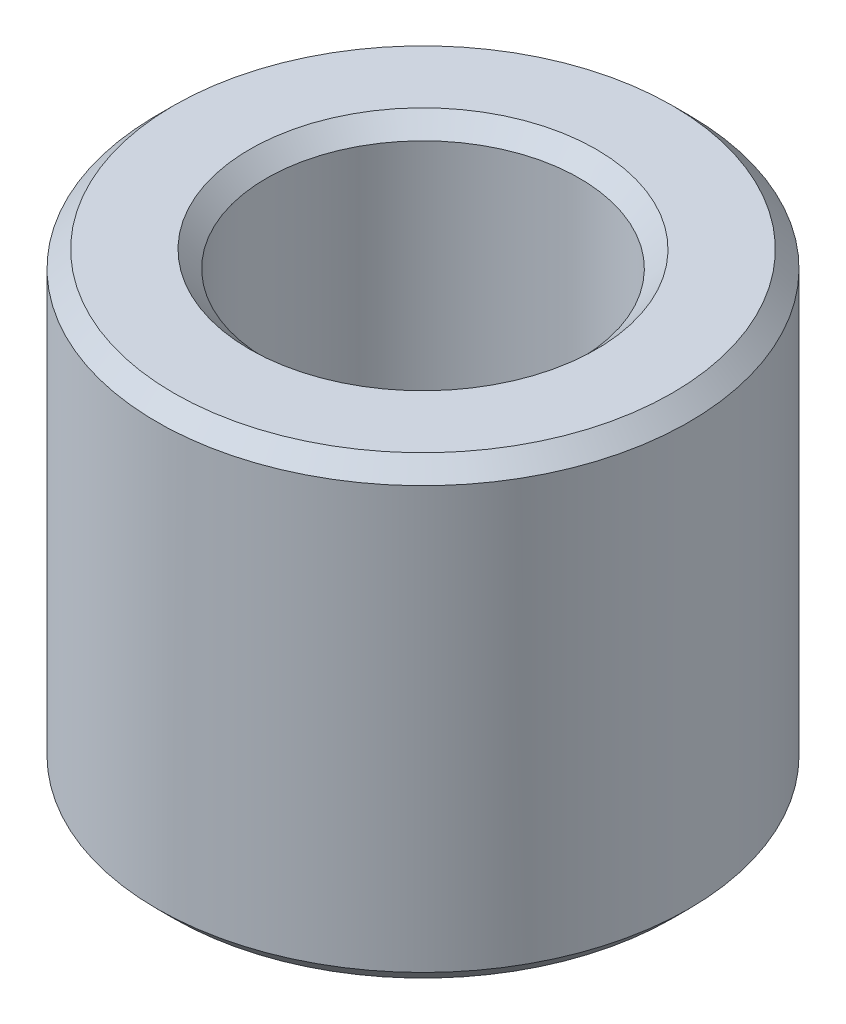
ISO-10303-21;
HEADER;
FILE_DESCRIPTION(('STEP AP214'),'2;1');
FILE_NAME('part.step','',(''),(''),'','','');
FILE_SCHEMA(('AUTOMOTIVE_DESIGN { 1 0 10303 214 1 1 1 1 }'));
ENDSEC;
DATA;
#1=APPLICATION_CONTEXT('core data for automotive mechanical design processes');
#2=APPLICATION_PROTOCOL_DEFINITION('international standard','automotive_design',2000,#1);
#3=PRODUCT_CONTEXT('',#1,'mechanical');
#4=PRODUCT('Part','Part','',(#3));
#5=PRODUCT_RELATED_PRODUCT_CATEGORY('part','',(#4));
#6=PRODUCT_DEFINITION_FORMATION('','',#4);
#7=PRODUCT_DEFINITION_CONTEXT('part definition',#1,'design');
#8=PRODUCT_DEFINITION('design','',#6,#7);
#9=PRODUCT_DEFINITION_SHAPE('','',#8);
#10=(LENGTH_UNIT() NAMED_UNIT(*) SI_UNIT(.MILLI.,.METRE.));
#11=(NAMED_UNIT(*) PLANE_ANGLE_UNIT() SI_UNIT($,.RADIAN.));
#12=(NAMED_UNIT(*) SI_UNIT($,.STERADIAN.) SOLID_ANGLE_UNIT());
#13=UNCERTAINTY_MEASURE_WITH_UNIT(LENGTH_MEASURE(1.E-05),#10,'distance_accuracy_value','');
#14=(GEOMETRIC_REPRESENTATION_CONTEXT(3) GLOBAL_UNCERTAINTY_ASSIGNED_CONTEXT((#13)) GLOBAL_UNIT_ASSIGNED_CONTEXT((#10,
#11,#12)) REPRESENTATION_CONTEXT('',''));
#15=CARTESIAN_POINT('',(0.,0.,0.));
#16=DIRECTION('',(0.,0.,1.));
#17=DIRECTION('',(1.,0.,0.));
#18=AXIS2_PLACEMENT_3D('',#15,#16,#17);
#19=CARTESIAN_POINT('',(0.,12.8342422328226,0.));
#20=DIRECTION('',(0.,-1.,0.));
#21=DIRECTION('',(0.,0.,-1.));
#22=AXIS2_PLACEMENT_3D('',#19,#20,#21);
#23=CYLINDRICAL_SURFACE('',#22,7.5);
#24=CARTESIAN_POINT('',(0.,0.471792199141811,0.));
#25=DIRECTION('',(0.,1.,0.));
#26=DIRECTION('',(0.,0.,1.));
#27=AXIS2_PLACEMENT_3D('',#24,#25,#26);
#28=CIRCLE('',#27,7.5);
#29=CARTESIAN_POINT('',(0.,0.471792199141811,7.5));
#30=VERTEX_POINT('',#29);
#31=EDGE_CURVE('E10',#30,#30,#28,.T.);
#32=ORIENTED_EDGE('',*,*,#31,.T.);
#33=EDGE_LOOP('',(#32));
#34=FACE_BOUND('',#33,.T.);
#35=CARTESIAN_POINT('',(0.,12.3624500336808,0.));
#36=DIRECTION('',(0.,1.,0.));
#37=DIRECTION('',(0.,0.,1.));
#38=AXIS2_PLACEMENT_3D('',#35,#36,#37);
#39=CIRCLE('',#38,7.5);
#40=CARTESIAN_POINT('',(0.,12.3624500336808,-7.5));
#41=VERTEX_POINT('',#40);
#42=EDGE_CURVE('E50',#41,#41,#39,.F.);
#43=ORIENTED_EDGE('',*,*,#42,.T.);
#44=EDGE_LOOP('',(#43));
#45=FACE_BOUND('',#44,.T.);
#46=ADVANCED_FACE('F39',(#34,#45),#23,.T.);
#47=CARTESIAN_POINT('',(0.,12.8342422328226,0.));
#48=DIRECTION('',(0.,1.,0.));
#49=DIRECTION('',(0.,0.,1.));
#50=AXIS2_PLACEMENT_3D('',#47,#48,#49);
#51=PLANE('',#50);
#52=CARTESIAN_POINT('',(0.,12.8342422328226,0.));
#53=DIRECTION('',(0.,1.,0.));
#54=DIRECTION('',(0.,0.,1.));
#55=AXIS2_PLACEMENT_3D('',#52,#53,#54);
#56=CIRCLE('',#55,4.88742388616947);
#57=CARTESIAN_POINT('',(0.,12.8342422328226,4.88742388616947));
#58=VERTEX_POINT('',#57);
#59=EDGE_CURVE('E58',#58,#58,#56,.F.);
#60=ORIENTED_EDGE('',*,*,#59,.T.);
#61=EDGE_LOOP('',(#60));
#62=FACE_BOUND('',#61,.T.);
#63=CARTESIAN_POINT('',(0.,12.8342422328226,0.));
#64=DIRECTION('',(0.,1.,0.));
#65=DIRECTION('',(0.,0.,1.));
#66=AXIS2_PLACEMENT_3D('',#63,#64,#65);
#67=CIRCLE('',#66,7.02820780085818);
#68=CARTESIAN_POINT('',(0.,12.8342422328226,-7.02820780085818));
#69=VERTEX_POINT('',#68);
#70=EDGE_CURVE('E61',#69,#69,#67,.T.);
#71=ORIENTED_EDGE('',*,*,#70,.T.);
#72=EDGE_LOOP('',(#71));
#73=FACE_BOUND('',#72,.T.);
#74=ADVANCED_FACE('F88',(#62,#73),#51,.T.);
#75=CARTESIAN_POINT('',(0.,0.,0.));
#76=DIRECTION('',(0.,1.,0.));
#77=DIRECTION('',(0.,0.,1.));
#78=AXIS2_PLACEMENT_3D('',#75,#76,#77);
#79=PLANE('',#78);
#80=CARTESIAN_POINT('',(0.,0.,0.));
#81=DIRECTION('',(0.,1.,0.));
#82=DIRECTION('',(0.,0.,1.));
#83=AXIS2_PLACEMENT_3D('',#80,#81,#82);
#84=CIRCLE('',#83,4.88742388616947);
#85=CARTESIAN_POINT('',(0.,0.,4.88742388616947));
#86=VERTEX_POINT('',#85);
#87=EDGE_CURVE('E51',#86,#86,#84,.T.);
#88=ORIENTED_EDGE('',*,*,#87,.T.);
#89=EDGE_LOOP('',(#88));
#90=FACE_BOUND('',#89,.T.);
#91=CARTESIAN_POINT('',(0.,0.,0.));
#92=DIRECTION('',(0.,1.,0.));
#93=DIRECTION('',(0.,0.,1.));
#94=AXIS2_PLACEMENT_3D('',#91,#92,#93);
#95=CIRCLE('',#94,7.02820780085819);
#96=CARTESIAN_POINT('',(0.,0.,7.02820780085819));
#97=VERTEX_POINT('',#96);
#98=EDGE_CURVE('E54',#97,#97,#95,.F.);
#99=ORIENTED_EDGE('',*,*,#98,.T.);
#100=EDGE_LOOP('',(#99));
#101=FACE_BOUND('',#100,.T.);
#102=ADVANCED_FACE('F83',(#90,#101),#79,.F.);
#103=CARTESIAN_POINT('',(0.,12.8342422328226,0.));
#104=DIRECTION('',(0.,-1.,0.));
#105=DIRECTION('',(0.,0.,-1.));
#106=AXIS2_PLACEMENT_3D('',#103,#104,#105);
#107=CYLINDRICAL_SURFACE('',#106,4.41563168702766);
#108=CARTESIAN_POINT('',(0.,12.3624500336808,0.));
#109=DIRECTION('',(0.,1.,0.));
#110=DIRECTION('',(0.,0.,1.));
#111=AXIS2_PLACEMENT_3D('',#108,#109,#110);
#112=CIRCLE('',#111,4.41563168702766);
#113=CARTESIAN_POINT('',(0.,12.3624500336808,4.41563168702766));
#114=VERTEX_POINT('',#113);
#115=EDGE_CURVE('E67',#114,#114,#112,.T.);
#116=ORIENTED_EDGE('',*,*,#115,.T.);
#117=EDGE_LOOP('',(#116));
#118=FACE_BOUND('',#117,.T.);
#119=CARTESIAN_POINT('',(0.,0.471792199141811,0.));
#120=DIRECTION('',(0.,1.,0.));
#121=DIRECTION('',(0.,0.,1.));
#122=AXIS2_PLACEMENT_3D('',#119,#120,#121);
#123=CIRCLE('',#122,4.41563168702766);
#124=CARTESIAN_POINT('',(0.,0.471792199141811,4.41563168702766));
#125=VERTEX_POINT('',#124);
#126=EDGE_CURVE('E69',#125,#125,#123,.F.);
#127=ORIENTED_EDGE('',*,*,#126,.T.);
#128=EDGE_LOOP('',(#127));
#129=FACE_BOUND('',#128,.T.);
#130=ADVANCED_FACE('F71',(#118,#129),#107,.F.);
#131=CARTESIAN_POINT('',(0.,12.3624500336808,0.));
#132=DIRECTION('',(0.,1.,0.));
#133=DIRECTION('',(0.,0.,1.));
#134=AXIS2_PLACEMENT_3D('',#131,#132,#133);
#135=CONICAL_SURFACE('',#134,4.41563168702766,0.785398163397451);
#136=ORIENTED_EDGE('',*,*,#59,.F.);
#137=EDGE_LOOP('',(#136));
#138=FACE_BOUND('',#137,.T.);
#139=ORIENTED_EDGE('',*,*,#115,.F.);
#140=EDGE_LOOP('',(#139));
#141=FACE_BOUND('',#140,.T.);
#142=ADVANCED_FACE('F77',(#138,#141),#135,.F.);
#143=CARTESIAN_POINT('',(0.,0.,0.));
#144=DIRECTION('',(0.,-1.,0.));
#145=DIRECTION('',(0.,0.,-1.));
#146=AXIS2_PLACEMENT_3D('',#143,#144,#145);
#147=CONICAL_SURFACE('',#146,4.88742388616947,0.785398163397447);
#148=ORIENTED_EDGE('',*,*,#126,.F.);
#149=EDGE_LOOP('',(#148));
#150=FACE_BOUND('',#149,.T.);
#151=ORIENTED_EDGE('',*,*,#87,.F.);
#152=EDGE_LOOP('',(#151));
#153=FACE_BOUND('',#152,.T.);
#154=ADVANCED_FACE('F73',(#150,#153),#147,.F.);
#155=CARTESIAN_POINT('',(0.,0.471792199141811,0.));
#156=DIRECTION('',(0.,1.,0.));
#157=DIRECTION('',(0.,0.,1.));
#158=AXIS2_PLACEMENT_3D('',#155,#156,#157);
#159=CONICAL_SURFACE('',#158,7.5,0.785398163397452);
#160=ORIENTED_EDGE('',*,*,#98,.F.);
#161=EDGE_LOOP('',(#160));
#162=FACE_BOUND('',#161,.T.);
#163=ORIENTED_EDGE('',*,*,#31,.F.);
#164=EDGE_LOOP('',(#163));
#165=FACE_BOUND('',#164,.T.);
#166=ADVANCED_FACE('F76',(#162,#165),#159,.T.);
#167=CARTESIAN_POINT('',(0.,12.8342422328226,0.));
#168=DIRECTION('',(0.,-1.,0.));
#169=DIRECTION('',(0.,0.,-1.));
#170=AXIS2_PLACEMENT_3D('',#167,#168,#169);
#171=CONICAL_SURFACE('',#170,7.02820780085818,0.785398163397445);
#172=CARTESIAN_POINT('',(0.,12.3624500336808,-7.5));
#173=CARTESIAN_POINT('',(0.,12.3673645357552,-7.49508549792561));
#174=CARTESIAN_POINT('',(0.,12.3722790378296,-7.49017099585121));
#175=CARTESIAN_POINT('',(0.,12.3821080419784,-7.48034199170243));
#176=CARTESIAN_POINT('',(0.,12.3870225440528,-7.47542748962803));
#177=CARTESIAN_POINT('',(0.,12.3968515482015,-7.46559848547924));
#178=CARTESIAN_POINT('',(0.,12.4017660502759,-7.46068398340485));
#179=CARTESIAN_POINT('',(0.,12.4115950544247,-7.45085497925606));
#180=CARTESIAN_POINT('',(0.,12.4165095564991,-7.44594047718167));
#181=CARTESIAN_POINT('',(0.,12.4263385606479,-7.43611147303288));
#182=CARTESIAN_POINT('',(0.,12.4312530627223,-7.43119697095849));
#183=CARTESIAN_POINT('',(0.,12.4410820668711,-7.4213679668097));
#184=CARTESIAN_POINT('',(0.,12.4459965689455,-7.4164534647353));
#185=CARTESIAN_POINT('',(0.,12.4558255730943,-7.40662446058652));
#186=CARTESIAN_POINT('',(0.,12.4607400751687,-7.40170995851212));
#187=CARTESIAN_POINT('',(0.,12.4705690793175,-7.39188095436333));
#188=CARTESIAN_POINT('',(0.,12.4754835813919,-7.38696645228894));
#189=CARTESIAN_POINT('',(0.,12.4853125855406,-7.37713744814015));
#190=CARTESIAN_POINT('',(0.,12.490227087615,-7.37222294606576));
#191=CARTESIAN_POINT('',(0.,12.5000560917638,-7.36239394191697));
#192=CARTESIAN_POINT('',(0.,12.5049705938382,-7.35747943984258));
#193=CARTESIAN_POINT('',(0.,12.514799597987,-7.34765043569379));
#194=CARTESIAN_POINT('',(0.,12.5197141000614,-7.3427359336194));
#195=CARTESIAN_POINT('',(0.,12.5295431042102,-7.33290692947061));
#196=CARTESIAN_POINT('',(0.,12.5344576062846,-7.32799242739621));
#197=CARTESIAN_POINT('',(0.,12.5442866104334,-7.31816342324743));
#198=CARTESIAN_POINT('',(0.,12.5492011125078,-7.31324892117303));
#199=CARTESIAN_POINT('',(0.,12.5590301166566,-7.30341991702424));
#200=CARTESIAN_POINT('',(0.,12.5639446187309,-7.29850541494985));
#201=CARTESIAN_POINT('',(0.,12.5737736228797,-7.28867641080106));
#202=CARTESIAN_POINT('',(0.,12.5786881249541,-7.28376190872667));
#203=CARTESIAN_POINT('',(0.,12.5885171291029,-7.27393290457788));
#204=CARTESIAN_POINT('',(0.,12.5934316311773,-7.26901840250349));
#205=CARTESIAN_POINT('',(0.,12.6032606353261,-7.2591893983547));
#206=CARTESIAN_POINT('',(0.,12.6081751374005,-7.2542748962803));
#207=CARTESIAN_POINT('',(0.,12.6180041415493,-7.24444589213152));
#208=CARTESIAN_POINT('',(0.,12.6229186436237,-7.23953139005712));
#209=CARTESIAN_POINT('',(0.,12.6327476477725,-7.22970238590834));
#210=CARTESIAN_POINT('',(0.,12.6376621498469,-7.22478788383394));
#211=CARTESIAN_POINT('',(0.,12.6474911539956,-7.21495887968515));
#212=CARTESIAN_POINT('',(0.,12.65240565607,-7.21004437761076));
#213=CARTESIAN_POINT('',(0.,12.6622346602188,-7.20021537346197));
#214=CARTESIAN_POINT('',(0.,12.6671491622932,-7.19530087138758));
#215=CARTESIAN_POINT('',(0.,12.676978166442,-7.18547186723879));
#216=CARTESIAN_POINT('',(0.,12.6818926685164,-7.1805573651644));
#217=CARTESIAN_POINT('',(0.,12.6917216726652,-7.17072836101561));
#218=CARTESIAN_POINT('',(0.,12.6966361747396,-7.16581385894121));
#219=CARTESIAN_POINT('',(0.,12.7064651788884,-7.15598485479243));
#220=CARTESIAN_POINT('',(0.,12.7113796809628,-7.15107035271803));
#221=CARTESIAN_POINT('',(0.,12.7212086851116,-7.14124134856924));
#222=CARTESIAN_POINT('',(0.,12.7261231871859,-7.13632684649485));
#223=CARTESIAN_POINT('',(0.,12.7359521913347,-7.12649784234606));
#224=CARTESIAN_POINT('',(0.,12.7408666934091,-7.12158334027167));
#225=CARTESIAN_POINT('',(0.,12.7506956975579,-7.11175433612288));
#226=CARTESIAN_POINT('',(0.,12.7556101996323,-7.10683983404849));
#227=CARTESIAN_POINT('',(0.,12.7654392037811,-7.0970108298997));
#228=CARTESIAN_POINT('',(0.,12.7703537058555,-7.09209632782531));
#229=CARTESIAN_POINT('',(0.,12.7801827100043,-7.08226732367652));
#230=CARTESIAN_POINT('',(0.,12.7850972120787,-7.07735282160212));
#231=CARTESIAN_POINT('',(0.,12.7949262162275,-7.06752381745333));
#232=CARTESIAN_POINT('',(0.,12.7998407183019,-7.06260931537894));
#233=CARTESIAN_POINT('',(0.,12.8096697224506,-7.05278031123015));
#234=CARTESIAN_POINT('',(0.,12.814584224525,-7.04786580915576));
#235=CARTESIAN_POINT('',(0.,12.8244132286738,-7.03803680500697));
#236=CARTESIAN_POINT('',(0.,12.8293277307482,-7.03312230293258));
#237=CARTESIAN_POINT('',(0.,12.8342422328226,-7.02820780085818));
#238=B_SPLINE_CURVE_WITH_KNOTS('',3,(#172,#173,#174,#175,#176,#177,#178,#179,#180,#181,#182,
#183,#184,#185,#186,#187,#188,#189,#190,#191,#192,#193,#194,#195,#196,#197,#198,#199,#200,#201,
#202,#203,#204,#205,#206,#207,#208,#209,#210,#211,#212,#213,#214,#215,#216,#217,#218,#219,#220,
#221,#222,#223,#224,#225,#226,#227,#228,#229,#230,#231,#232,#233,#234,#235,#236,#237),
.UNSPECIFIED.,.F.,.F.,(4,2,2,2,2,2,2,2,2,2,2,2,2,2,2,2,2,2,2,2,2,2,2,2,2,2,2,2,2,2,2,2,4),(0.,
0.020850466457755,0.0417009329155112,0.0625513993732662,0.0834018658310225,0.104252332288779,
0.125102798746534,0.145953265204291,0.166803731662047,0.187654198119802,0.208504664577558,
0.229355131035313,0.250205597493069,0.271056063950826,0.291906530408581,0.312756996866337,
0.333607463324094,0.354457929781849,0.375308396239605,0.39615886269736,0.417009329155116,
0.437859795612873,0.458710262070628,0.479560728528384,0.50041119498614,0.521261661443895,
0.542112127901652,0.562962594359407,0.583813060817163,0.60466352727492,0.625513993732675,
0.646364460190431,0.667214926648187),.UNSPECIFIED.);
#239=EDGE_CURVE('BSEAM45',#41,#69,#238,.T.);
#240=ORIENTED_EDGE('',*,*,#42,.F.);
#241=ORIENTED_EDGE('',*,*,#70,.F.);
#242=ORIENTED_EDGE('',*,*,#239,.T.);
#243=ORIENTED_EDGE('',*,*,#239,.F.);
#244=EDGE_LOOP('',(#240,#242,#241,#243));
#245=FACE_BOUND('',#244,.T.);
#246=ADVANCED_FACE('F45',(#245),#171,.T.);
#247=CLOSED_SHELL('',(#46,#74,#102,#130,#142,#154,#166,#246));
#248=MANIFOLD_SOLID_BREP('B2',#247);
#249=ADVANCED_BREP_SHAPE_REPRESENTATION('',(#18,#248),#14);
#250=SHAPE_DEFINITION_REPRESENTATION(#9,#249);
ENDSEC;
END-ISO-10303-21;
